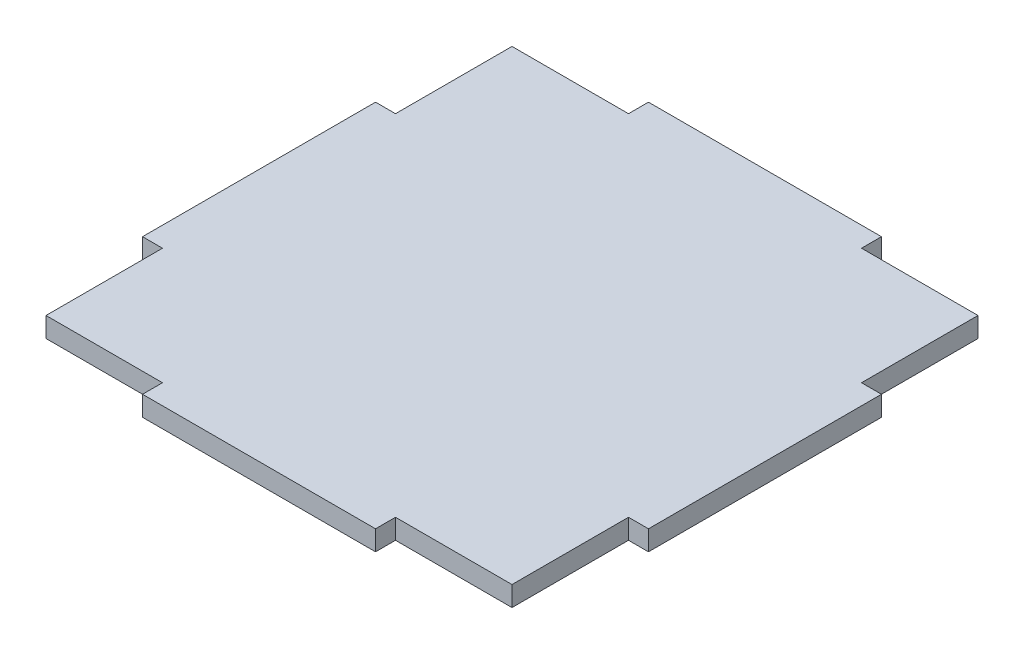
ISO-10303-21;
HEADER;
FILE_DESCRIPTION(('STEP AP214'),'2;1');
FILE_NAME('part.step','',(''),(''),'','','');
FILE_SCHEMA(('AUTOMOTIVE_DESIGN { 1 0 10303 214 1 1 1 1 }'));
ENDSEC;
DATA;
#1=APPLICATION_CONTEXT('core data for automotive mechanical design processes');
#2=APPLICATION_PROTOCOL_DEFINITION('international standard','automotive_design',2000,#1);
#3=PRODUCT_CONTEXT('',#1,'mechanical');
#4=PRODUCT('Part','Part','',(#3));
#5=PRODUCT_RELATED_PRODUCT_CATEGORY('part','',(#4));
#6=PRODUCT_DEFINITION_FORMATION('','',#4);
#7=PRODUCT_DEFINITION_CONTEXT('part definition',#1,'design');
#8=PRODUCT_DEFINITION('design','',#6,#7);
#9=PRODUCT_DEFINITION_SHAPE('','',#8);
#10=(LENGTH_UNIT() NAMED_UNIT(*) SI_UNIT(.MILLI.,.METRE.));
#11=(NAMED_UNIT(*) PLANE_ANGLE_UNIT() SI_UNIT($,.RADIAN.));
#12=(NAMED_UNIT(*) SI_UNIT($,.STERADIAN.) SOLID_ANGLE_UNIT());
#13=UNCERTAINTY_MEASURE_WITH_UNIT(LENGTH_MEASURE(1.E-05),#10,'distance_accuracy_value','');
#14=(GEOMETRIC_REPRESENTATION_CONTEXT(3) GLOBAL_UNCERTAINTY_ASSIGNED_CONTEXT((#13)) GLOBAL_UNIT_ASSIGNED_CONTEXT((#10,
#11,#12)) REPRESENTATION_CONTEXT('',''));
#15=CARTESIAN_POINT('',(0.,0.,0.));
#16=DIRECTION('',(0.,0.,1.));
#17=DIRECTION('',(1.,0.,0.));
#18=AXIS2_PLACEMENT_3D('',#15,#16,#17);
#19=CARTESIAN_POINT('',(35.,3.,-17.5));
#20=DIRECTION('',(-1.,0.,0.));
#21=DIRECTION('',(0.,0.,1.));
#22=AXIS2_PLACEMENT_3D('',#19,#20,#21);
#23=PLANE('',#22);
#24=DIRECTION('',(0.,0.,-1.));
#25=VECTOR('',#24,1.);
#26=CARTESIAN_POINT('',(35.,0.,-17.5));
#27=LINE('',#26,#25);
#28=CARTESIAN_POINT('',(35.,0.,-17.5));
#29=VERTEX_POINT('',#28);
#30=CARTESIAN_POINT('',(35.,0.,-35.));
#31=VERTEX_POINT('',#30);
#32=EDGE_CURVE('E205',#29,#31,#27,.T.);
#33=ORIENTED_EDGE('',*,*,#32,.T.);
#34=DIRECTION('',(0.,-1.,0.));
#35=VECTOR('',#34,1.);
#36=CARTESIAN_POINT('',(35.,3.,-35.));
#37=LINE('',#36,#35);
#38=CARTESIAN_POINT('',(35.,3.,-35.));
#39=VERTEX_POINT('',#38);
#40=EDGE_CURVE('E11',#39,#31,#37,.T.);
#41=ORIENTED_EDGE('',*,*,#40,.F.);
#42=DIRECTION('',(0.,0.,-1.));
#43=VECTOR('',#42,1.);
#44=CARTESIAN_POINT('',(35.,3.,-17.5));
#45=LINE('',#44,#43);
#46=CARTESIAN_POINT('',(35.,3.,-17.5));
#47=VERTEX_POINT('',#46);
#48=EDGE_CURVE('E243',#47,#39,#45,.T.);
#49=ORIENTED_EDGE('',*,*,#48,.F.);
#50=DIRECTION('',(0.,-1.,0.));
#51=VECTOR('',#50,1.);
#52=CARTESIAN_POINT('',(35.,3.,-17.5));
#53=LINE('',#52,#51);
#54=EDGE_CURVE('E201',#47,#29,#53,.T.);
#55=ORIENTED_EDGE('',*,*,#54,.T.);
#56=EDGE_LOOP('',(#33,#41,#49,#55));
#57=FACE_BOUND('',#56,.T.);
#58=ADVANCED_FACE('F37',(#57),#23,.F.);
#59=CARTESIAN_POINT('',(17.5,3.,-35.));
#60=DIRECTION('',(0.,0.,1.));
#61=DIRECTION('',(1.,0.,0.));
#62=AXIS2_PLACEMENT_3D('',#59,#60,#61);
#63=PLANE('',#62);
#64=DIRECTION('',(-1.,0.,0.));
#65=VECTOR('',#64,1.);
#66=CARTESIAN_POINT('',(17.5,0.,-35.));
#67=LINE('',#66,#65);
#68=CARTESIAN_POINT('',(17.5,0.,-35.));
#69=VERTEX_POINT('',#68);
#70=EDGE_CURVE('E208',#31,#69,#67,.T.);
#71=ORIENTED_EDGE('',*,*,#70,.T.);
#72=DIRECTION('',(0.,-1.,0.));
#73=VECTOR('',#72,1.);
#74=CARTESIAN_POINT('',(17.5,3.,-35.));
#75=LINE('',#74,#73);
#76=CARTESIAN_POINT('',(17.5,3.,-35.));
#77=VERTEX_POINT('',#76);
#78=EDGE_CURVE('E45',#77,#69,#75,.T.);
#79=ORIENTED_EDGE('',*,*,#78,.F.);
#80=DIRECTION('',(-1.,0.,0.));
#81=VECTOR('',#80,1.);
#82=CARTESIAN_POINT('',(17.5,3.,-35.));
#83=LINE('',#82,#81);
#84=EDGE_CURVE('E132',#39,#77,#83,.T.);
#85=ORIENTED_EDGE('',*,*,#84,.F.);
#86=ORIENTED_EDGE('',*,*,#40,.T.);
#87=EDGE_LOOP('',(#71,#79,#85,#86));
#88=FACE_BOUND('',#87,.T.);
#89=ADVANCED_FACE('F361',(#88),#63,.F.);
#90=CARTESIAN_POINT('',(17.5,3.,-38.));
#91=DIRECTION('',(-1.,0.,0.));
#92=DIRECTION('',(0.,0.,1.));
#93=AXIS2_PLACEMENT_3D('',#90,#91,#92);
#94=PLANE('',#93);
#95=DIRECTION('',(0.,0.,-1.));
#96=VECTOR('',#95,1.);
#97=CARTESIAN_POINT('',(17.5,0.,-38.));
#98=LINE('',#97,#96);
#99=CARTESIAN_POINT('',(17.5,0.,-38.));
#100=VERTEX_POINT('',#99);
#101=EDGE_CURVE('E210',#69,#100,#98,.T.);
#102=ORIENTED_EDGE('',*,*,#101,.T.);
#103=DIRECTION('',(0.,-1.,0.));
#104=VECTOR('',#103,1.);
#105=CARTESIAN_POINT('',(17.5,3.,-38.));
#106=LINE('',#105,#104);
#107=CARTESIAN_POINT('',(17.5,3.,-38.));
#108=VERTEX_POINT('',#107);
#109=EDGE_CURVE('E286',#108,#100,#106,.T.);
#110=ORIENTED_EDGE('',*,*,#109,.F.);
#111=DIRECTION('',(0.,0.,-1.));
#112=VECTOR('',#111,1.);
#113=CARTESIAN_POINT('',(17.5,3.,-38.));
#114=LINE('',#113,#112);
#115=EDGE_CURVE('E294',#77,#108,#114,.T.);
#116=ORIENTED_EDGE('',*,*,#115,.F.);
#117=ORIENTED_EDGE('',*,*,#78,.T.);
#118=EDGE_LOOP('',(#102,#110,#116,#117));
#119=FACE_BOUND('',#118,.T.);
#120=ADVANCED_FACE('F292',(#119),#94,.F.);
#121=CARTESIAN_POINT('',(-17.5,3.,-38.));
#122=DIRECTION('',(0.,0.,1.));
#123=DIRECTION('',(1.,0.,0.));
#124=AXIS2_PLACEMENT_3D('',#121,#122,#123);
#125=PLANE('',#124);
#126=DIRECTION('',(-1.,0.,0.));
#127=VECTOR('',#126,1.);
#128=CARTESIAN_POINT('',(-17.5,0.,-38.));
#129=LINE('',#128,#127);
#130=CARTESIAN_POINT('',(-17.5,0.,-38.));
#131=VERTEX_POINT('',#130);
#132=EDGE_CURVE('E212',#100,#131,#129,.T.);
#133=ORIENTED_EDGE('',*,*,#132,.T.);
#134=DIRECTION('',(0.,-1.,0.));
#135=VECTOR('',#134,1.);
#136=CARTESIAN_POINT('',(-17.5,3.,-38.));
#137=LINE('',#136,#135);
#138=CARTESIAN_POINT('',(-17.5,3.,-38.));
#139=VERTEX_POINT('',#138);
#140=EDGE_CURVE('E283',#139,#131,#137,.T.);
#141=ORIENTED_EDGE('',*,*,#140,.F.);
#142=DIRECTION('',(-1.,0.,0.));
#143=VECTOR('',#142,1.);
#144=CARTESIAN_POINT('',(-17.5,3.,-38.));
#145=LINE('',#144,#143);
#146=EDGE_CURVE('E312',#108,#139,#145,.T.);
#147=ORIENTED_EDGE('',*,*,#146,.F.);
#148=ORIENTED_EDGE('',*,*,#109,.T.);
#149=EDGE_LOOP('',(#133,#141,#147,#148));
#150=FACE_BOUND('',#149,.T.);
#151=ADVANCED_FACE('F303',(#150),#125,.F.);
#152=CARTESIAN_POINT('',(-17.5,3.,-38.));
#153=DIRECTION('',(1.,0.,0.));
#154=DIRECTION('',(0.,0.,-1.));
#155=AXIS2_PLACEMENT_3D('',#152,#153,#154);
#156=PLANE('',#155);
#157=DIRECTION('',(0.,0.,1.));
#158=VECTOR('',#157,1.);
#159=CARTESIAN_POINT('',(-17.5,0.,-38.));
#160=LINE('',#159,#158);
#161=CARTESIAN_POINT('',(-17.5,0.,-35.));
#162=VERTEX_POINT('',#161);
#163=EDGE_CURVE('E214',#131,#162,#160,.T.);
#164=ORIENTED_EDGE('',*,*,#163,.T.);
#165=DIRECTION('',(0.,-1.,0.));
#166=VECTOR('',#165,1.);
#167=CARTESIAN_POINT('',(-17.5,3.,-35.));
#168=LINE('',#167,#166);
#169=CARTESIAN_POINT('',(-17.5,3.,-35.));
#170=VERTEX_POINT('',#169);
#171=EDGE_CURVE('E280',#170,#162,#168,.T.);
#172=ORIENTED_EDGE('',*,*,#171,.F.);
#173=DIRECTION('',(0.,0.,1.));
#174=VECTOR('',#173,1.);
#175=CARTESIAN_POINT('',(-17.5,3.,-38.));
#176=LINE('',#175,#174);
#177=EDGE_CURVE('E309',#139,#170,#176,.T.);
#178=ORIENTED_EDGE('',*,*,#177,.F.);
#179=ORIENTED_EDGE('',*,*,#140,.T.);
#180=EDGE_LOOP('',(#164,#172,#178,#179));
#181=FACE_BOUND('',#180,.T.);
#182=ADVANCED_FACE('F307',(#181),#156,.F.);
#183=CARTESIAN_POINT('',(-35.,3.,-35.));
#184=DIRECTION('',(0.,0.,1.));
#185=DIRECTION('',(1.,0.,0.));
#186=AXIS2_PLACEMENT_3D('',#183,#184,#185);
#187=PLANE('',#186);
#188=DIRECTION('',(-1.,0.,0.));
#189=VECTOR('',#188,1.);
#190=CARTESIAN_POINT('',(-35.,0.,-35.));
#191=LINE('',#190,#189);
#192=CARTESIAN_POINT('',(-35.,0.,-35.));
#193=VERTEX_POINT('',#192);
#194=EDGE_CURVE('E216',#162,#193,#191,.T.);
#195=ORIENTED_EDGE('',*,*,#194,.T.);
#196=DIRECTION('',(0.,-1.,0.));
#197=VECTOR('',#196,1.);
#198=CARTESIAN_POINT('',(-35.,3.,-35.));
#199=LINE('',#198,#197);
#200=CARTESIAN_POINT('',(-35.,3.,-35.));
#201=VERTEX_POINT('',#200);
#202=EDGE_CURVE('E277',#201,#193,#199,.T.);
#203=ORIENTED_EDGE('',*,*,#202,.F.);
#204=DIRECTION('',(-1.,0.,0.));
#205=VECTOR('',#204,1.);
#206=CARTESIAN_POINT('',(-35.,3.,-35.));
#207=LINE('',#206,#205);
#208=EDGE_CURVE('E311',#170,#201,#207,.T.);
#209=ORIENTED_EDGE('',*,*,#208,.F.);
#210=ORIENTED_EDGE('',*,*,#171,.T.);
#211=EDGE_LOOP('',(#195,#203,#209,#210));
#212=FACE_BOUND('',#211,.T.);
#213=ADVANCED_FACE('F374',(#212),#187,.F.);
#214=CARTESIAN_POINT('',(-35.,3.,-17.5));
#215=DIRECTION('',(1.,0.,0.));
#216=DIRECTION('',(0.,0.,-1.));
#217=AXIS2_PLACEMENT_3D('',#214,#215,#216);
#218=PLANE('',#217);
#219=DIRECTION('',(0.,0.,1.));
#220=VECTOR('',#219,1.);
#221=CARTESIAN_POINT('',(-35.,0.,-17.5));
#222=LINE('',#221,#220);
#223=CARTESIAN_POINT('',(-35.,0.,-17.5));
#224=VERTEX_POINT('',#223);
#225=EDGE_CURVE('E218',#193,#224,#222,.T.);
#226=ORIENTED_EDGE('',*,*,#225,.T.);
#227=DIRECTION('',(0.,-1.,0.));
#228=VECTOR('',#227,1.);
#229=CARTESIAN_POINT('',(-35.,3.,-17.5));
#230=LINE('',#229,#228);
#231=CARTESIAN_POINT('',(-35.,3.,-17.5));
#232=VERTEX_POINT('',#231);
#233=EDGE_CURVE('E274',#232,#224,#230,.T.);
#234=ORIENTED_EDGE('',*,*,#233,.F.);
#235=DIRECTION('',(0.,0.,1.));
#236=VECTOR('',#235,1.);
#237=CARTESIAN_POINT('',(-35.,3.,-17.5));
#238=LINE('',#237,#236);
#239=EDGE_CURVE('E314',#201,#232,#238,.T.);
#240=ORIENTED_EDGE('',*,*,#239,.F.);
#241=ORIENTED_EDGE('',*,*,#202,.T.);
#242=EDGE_LOOP('',(#226,#234,#240,#241));
#243=FACE_BOUND('',#242,.T.);
#244=ADVANCED_FACE('F377',(#243),#218,.F.);
#245=CARTESIAN_POINT('',(-38.,3.,-17.5));
#246=DIRECTION('',(0.,0.,1.));
#247=DIRECTION('',(1.,0.,0.));
#248=AXIS2_PLACEMENT_3D('',#245,#246,#247);
#249=PLANE('',#248);
#250=DIRECTION('',(-1.,0.,0.));
#251=VECTOR('',#250,1.);
#252=CARTESIAN_POINT('',(-38.,0.,-17.5));
#253=LINE('',#252,#251);
#254=CARTESIAN_POINT('',(-38.,0.,-17.5));
#255=VERTEX_POINT('',#254);
#256=EDGE_CURVE('E220',#224,#255,#253,.T.);
#257=ORIENTED_EDGE('',*,*,#256,.T.);
#258=DIRECTION('',(0.,-1.,0.));
#259=VECTOR('',#258,1.);
#260=CARTESIAN_POINT('',(-38.,3.,-17.5));
#261=LINE('',#260,#259);
#262=CARTESIAN_POINT('',(-38.,3.,-17.5));
#263=VERTEX_POINT('',#262);
#264=EDGE_CURVE('E271',#263,#255,#261,.T.);
#265=ORIENTED_EDGE('',*,*,#264,.F.);
#266=DIRECTION('',(-1.,0.,0.));
#267=VECTOR('',#266,1.);
#268=CARTESIAN_POINT('',(-38.,3.,-17.5));
#269=LINE('',#268,#267);
#270=EDGE_CURVE('E320',#232,#263,#269,.T.);
#271=ORIENTED_EDGE('',*,*,#270,.F.);
#272=ORIENTED_EDGE('',*,*,#233,.T.);
#273=EDGE_LOOP('',(#257,#265,#271,#272));
#274=FACE_BOUND('',#273,.T.);
#275=ADVANCED_FACE('F381',(#274),#249,.F.);
#276=CARTESIAN_POINT('',(-38.,3.,17.5));
#277=DIRECTION('',(1.,0.,0.));
#278=DIRECTION('',(0.,0.,-1.));
#279=AXIS2_PLACEMENT_3D('',#276,#277,#278);
#280=PLANE('',#279);
#281=DIRECTION('',(0.,0.,1.));
#282=VECTOR('',#281,1.);
#283=CARTESIAN_POINT('',(-38.,0.,17.5));
#284=LINE('',#283,#282);
#285=CARTESIAN_POINT('',(-38.,0.,17.5));
#286=VERTEX_POINT('',#285);
#287=EDGE_CURVE('E222',#255,#286,#284,.T.);
#288=ORIENTED_EDGE('',*,*,#287,.T.);
#289=DIRECTION('',(0.,-1.,0.));
#290=VECTOR('',#289,1.);
#291=CARTESIAN_POINT('',(-38.,3.,17.5));
#292=LINE('',#291,#290);
#293=CARTESIAN_POINT('',(-38.,3.,17.5));
#294=VERTEX_POINT('',#293);
#295=EDGE_CURVE('E268',#294,#286,#292,.T.);
#296=ORIENTED_EDGE('',*,*,#295,.F.);
#297=DIRECTION('',(0.,0.,1.));
#298=VECTOR('',#297,1.);
#299=CARTESIAN_POINT('',(-38.,3.,17.5));
#300=LINE('',#299,#298);
#301=EDGE_CURVE('E322',#263,#294,#300,.T.);
#302=ORIENTED_EDGE('',*,*,#301,.F.);
#303=ORIENTED_EDGE('',*,*,#264,.T.);
#304=EDGE_LOOP('',(#288,#296,#302,#303));
#305=FACE_BOUND('',#304,.T.);
#306=ADVANCED_FACE('F385',(#305),#280,.F.);
#307=CARTESIAN_POINT('',(-38.,3.,17.5));
#308=DIRECTION('',(0.,0.,-1.));
#309=DIRECTION('',(-1.,0.,0.));
#310=AXIS2_PLACEMENT_3D('',#307,#308,#309);
#311=PLANE('',#310);
#312=DIRECTION('',(1.,0.,0.));
#313=VECTOR('',#312,1.);
#314=CARTESIAN_POINT('',(-38.,0.,17.5));
#315=LINE('',#314,#313);
#316=CARTESIAN_POINT('',(-35.,0.,17.5));
#317=VERTEX_POINT('',#316);
#318=EDGE_CURVE('E224',#286,#317,#315,.T.);
#319=ORIENTED_EDGE('',*,*,#318,.T.);
#320=DIRECTION('',(0.,-1.,0.));
#321=VECTOR('',#320,1.);
#322=CARTESIAN_POINT('',(-35.,3.,17.5));
#323=LINE('',#322,#321);
#324=CARTESIAN_POINT('',(-35.,3.,17.5));
#325=VERTEX_POINT('',#324);
#326=EDGE_CURVE('E265',#325,#317,#323,.T.);
#327=ORIENTED_EDGE('',*,*,#326,.F.);
#328=DIRECTION('',(1.,0.,0.));
#329=VECTOR('',#328,1.);
#330=CARTESIAN_POINT('',(-38.,3.,17.5));
#331=LINE('',#330,#329);
#332=EDGE_CURVE('E324',#294,#325,#331,.T.);
#333=ORIENTED_EDGE('',*,*,#332,.F.);
#334=ORIENTED_EDGE('',*,*,#295,.T.);
#335=EDGE_LOOP('',(#319,#327,#333,#334));
#336=FACE_BOUND('',#335,.T.);
#337=ADVANCED_FACE('F389',(#336),#311,.F.);
#338=CARTESIAN_POINT('',(-35.,3.,35.));
#339=DIRECTION('',(1.,0.,0.));
#340=DIRECTION('',(0.,0.,-1.));
#341=AXIS2_PLACEMENT_3D('',#338,#339,#340);
#342=PLANE('',#341);
#343=DIRECTION('',(0.,0.,1.));
#344=VECTOR('',#343,1.);
#345=CARTESIAN_POINT('',(-35.,0.,35.));
#346=LINE('',#345,#344);
#347=CARTESIAN_POINT('',(-35.,0.,35.));
#348=VERTEX_POINT('',#347);
#349=EDGE_CURVE('E226',#317,#348,#346,.T.);
#350=ORIENTED_EDGE('',*,*,#349,.T.);
#351=DIRECTION('',(0.,-1.,0.));
#352=VECTOR('',#351,1.);
#353=CARTESIAN_POINT('',(-35.,3.,35.));
#354=LINE('',#353,#352);
#355=CARTESIAN_POINT('',(-35.,3.,35.));
#356=VERTEX_POINT('',#355);
#357=EDGE_CURVE('E262',#356,#348,#354,.T.);
#358=ORIENTED_EDGE('',*,*,#357,.F.);
#359=DIRECTION('',(0.,0.,1.));
#360=VECTOR('',#359,1.);
#361=CARTESIAN_POINT('',(-35.,3.,35.));
#362=LINE('',#361,#360);
#363=EDGE_CURVE('E326',#325,#356,#362,.T.);
#364=ORIENTED_EDGE('',*,*,#363,.F.);
#365=ORIENTED_EDGE('',*,*,#326,.T.);
#366=EDGE_LOOP('',(#350,#358,#364,#365));
#367=FACE_BOUND('',#366,.T.);
#368=ADVANCED_FACE('F393',(#367),#342,.F.);
#369=CARTESIAN_POINT('',(-35.,3.,35.));
#370=DIRECTION('',(0.,0.,-1.));
#371=DIRECTION('',(-1.,0.,0.));
#372=AXIS2_PLACEMENT_3D('',#369,#370,#371);
#373=PLANE('',#372);
#374=DIRECTION('',(1.,0.,0.));
#375=VECTOR('',#374,1.);
#376=CARTESIAN_POINT('',(-35.,0.,35.));
#377=LINE('',#376,#375);
#378=CARTESIAN_POINT('',(-17.5,0.,35.));
#379=VERTEX_POINT('',#378);
#380=EDGE_CURVE('E228',#348,#379,#377,.T.);
#381=ORIENTED_EDGE('',*,*,#380,.T.);
#382=DIRECTION('',(0.,-1.,0.));
#383=VECTOR('',#382,1.);
#384=CARTESIAN_POINT('',(-17.5,3.,35.));
#385=LINE('',#384,#383);
#386=CARTESIAN_POINT('',(-17.5,3.,35.));
#387=VERTEX_POINT('',#386);
#388=EDGE_CURVE('E259',#387,#379,#385,.T.);
#389=ORIENTED_EDGE('',*,*,#388,.F.);
#390=DIRECTION('',(1.,0.,0.));
#391=VECTOR('',#390,1.);
#392=CARTESIAN_POINT('',(-35.,3.,35.));
#393=LINE('',#392,#391);
#394=EDGE_CURVE('E328',#356,#387,#393,.T.);
#395=ORIENTED_EDGE('',*,*,#394,.F.);
#396=ORIENTED_EDGE('',*,*,#357,.T.);
#397=EDGE_LOOP('',(#381,#389,#395,#396));
#398=FACE_BOUND('',#397,.T.);
#399=ADVANCED_FACE('F397',(#398),#373,.F.);
#400=CARTESIAN_POINT('',(-17.5,3.,38.));
#401=DIRECTION('',(1.,0.,0.));
#402=DIRECTION('',(0.,0.,-1.));
#403=AXIS2_PLACEMENT_3D('',#400,#401,#402);
#404=PLANE('',#403);
#405=DIRECTION('',(0.,0.,1.));
#406=VECTOR('',#405,1.);
#407=CARTESIAN_POINT('',(-17.5,0.,38.));
#408=LINE('',#407,#406);
#409=CARTESIAN_POINT('',(-17.5,0.,38.));
#410=VERTEX_POINT('',#409);
#411=EDGE_CURVE('E230',#379,#410,#408,.T.);
#412=ORIENTED_EDGE('',*,*,#411,.T.);
#413=DIRECTION('',(0.,-1.,0.));
#414=VECTOR('',#413,1.);
#415=CARTESIAN_POINT('',(-17.5,3.,38.));
#416=LINE('',#415,#414);
#417=CARTESIAN_POINT('',(-17.5,3.,38.));
#418=VERTEX_POINT('',#417);
#419=EDGE_CURVE('E256',#418,#410,#416,.T.);
#420=ORIENTED_EDGE('',*,*,#419,.F.);
#421=DIRECTION('',(0.,0.,1.));
#422=VECTOR('',#421,1.);
#423=CARTESIAN_POINT('',(-17.5,3.,38.));
#424=LINE('',#423,#422);
#425=EDGE_CURVE('E330',#387,#418,#424,.T.);
#426=ORIENTED_EDGE('',*,*,#425,.F.);
#427=ORIENTED_EDGE('',*,*,#388,.T.);
#428=EDGE_LOOP('',(#412,#420,#426,#427));
#429=FACE_BOUND('',#428,.T.);
#430=ADVANCED_FACE('F401',(#429),#404,.F.);
#431=CARTESIAN_POINT('',(-17.5,3.,38.));
#432=DIRECTION('',(0.,0.,-1.));
#433=DIRECTION('',(-1.,0.,0.));
#434=AXIS2_PLACEMENT_3D('',#431,#432,#433);
#435=PLANE('',#434);
#436=DIRECTION('',(1.,0.,0.));
#437=VECTOR('',#436,1.);
#438=CARTESIAN_POINT('',(-17.5,0.,38.));
#439=LINE('',#438,#437);
#440=CARTESIAN_POINT('',(17.5,0.,38.));
#441=VERTEX_POINT('',#440);
#442=EDGE_CURVE('E232',#410,#441,#439,.T.);
#443=ORIENTED_EDGE('',*,*,#442,.T.);
#444=DIRECTION('',(0.,-1.,0.));
#445=VECTOR('',#444,1.);
#446=CARTESIAN_POINT('',(17.5,3.,38.));
#447=LINE('',#446,#445);
#448=CARTESIAN_POINT('',(17.5,3.,38.));
#449=VERTEX_POINT('',#448);
#450=EDGE_CURVE('E253',#449,#441,#447,.T.);
#451=ORIENTED_EDGE('',*,*,#450,.F.);
#452=DIRECTION('',(1.,0.,0.));
#453=VECTOR('',#452,1.);
#454=CARTESIAN_POINT('',(-17.5,3.,38.));
#455=LINE('',#454,#453);
#456=EDGE_CURVE('E332',#418,#449,#455,.T.);
#457=ORIENTED_EDGE('',*,*,#456,.F.);
#458=ORIENTED_EDGE('',*,*,#419,.T.);
#459=EDGE_LOOP('',(#443,#451,#457,#458));
#460=FACE_BOUND('',#459,.T.);
#461=ADVANCED_FACE('F405',(#460),#435,.F.);
#462=CARTESIAN_POINT('',(17.5,3.,38.));
#463=DIRECTION('',(-1.,0.,0.));
#464=DIRECTION('',(0.,0.,1.));
#465=AXIS2_PLACEMENT_3D('',#462,#463,#464);
#466=PLANE('',#465);
#467=DIRECTION('',(0.,0.,-1.));
#468=VECTOR('',#467,1.);
#469=CARTESIAN_POINT('',(17.5,0.,38.));
#470=LINE('',#469,#468);
#471=CARTESIAN_POINT('',(17.5,0.,35.));
#472=VERTEX_POINT('',#471);
#473=EDGE_CURVE('E234',#441,#472,#470,.T.);
#474=ORIENTED_EDGE('',*,*,#473,.T.);
#475=DIRECTION('',(0.,-1.,0.));
#476=VECTOR('',#475,1.);
#477=CARTESIAN_POINT('',(17.5,3.,35.));
#478=LINE('',#477,#476);
#479=CARTESIAN_POINT('',(17.5,3.,35.));
#480=VERTEX_POINT('',#479);
#481=EDGE_CURVE('E250',#480,#472,#478,.T.);
#482=ORIENTED_EDGE('',*,*,#481,.F.);
#483=DIRECTION('',(0.,0.,-1.));
#484=VECTOR('',#483,1.);
#485=CARTESIAN_POINT('',(17.5,3.,38.));
#486=LINE('',#485,#484);
#487=EDGE_CURVE('E334',#449,#480,#486,.T.);
#488=ORIENTED_EDGE('',*,*,#487,.F.);
#489=ORIENTED_EDGE('',*,*,#450,.T.);
#490=EDGE_LOOP('',(#474,#482,#488,#489));
#491=FACE_BOUND('',#490,.T.);
#492=ADVANCED_FACE('F409',(#491),#466,.F.);
#493=CARTESIAN_POINT('',(17.5,3.,35.));
#494=DIRECTION('',(0.,0.,-1.));
#495=DIRECTION('',(-1.,0.,0.));
#496=AXIS2_PLACEMENT_3D('',#493,#494,#495);
#497=PLANE('',#496);
#498=DIRECTION('',(1.,0.,0.));
#499=VECTOR('',#498,1.);
#500=CARTESIAN_POINT('',(17.5,0.,35.));
#501=LINE('',#500,#499);
#502=CARTESIAN_POINT('',(35.,0.,35.));
#503=VERTEX_POINT('',#502);
#504=EDGE_CURVE('E236',#472,#503,#501,.T.);
#505=ORIENTED_EDGE('',*,*,#504,.T.);
#506=DIRECTION('',(0.,-1.,0.));
#507=VECTOR('',#506,1.);
#508=CARTESIAN_POINT('',(35.,3.,35.));
#509=LINE('',#508,#507);
#510=CARTESIAN_POINT('',(35.,3.,35.));
#511=VERTEX_POINT('',#510);
#512=EDGE_CURVE('E247',#511,#503,#509,.T.);
#513=ORIENTED_EDGE('',*,*,#512,.F.);
#514=DIRECTION('',(1.,0.,0.));
#515=VECTOR('',#514,1.);
#516=CARTESIAN_POINT('',(17.5,3.,35.));
#517=LINE('',#516,#515);
#518=EDGE_CURVE('E336',#480,#511,#517,.T.);
#519=ORIENTED_EDGE('',*,*,#518,.F.);
#520=ORIENTED_EDGE('',*,*,#481,.T.);
#521=EDGE_LOOP('',(#505,#513,#519,#520));
#522=FACE_BOUND('',#521,.T.);
#523=ADVANCED_FACE('F342',(#522),#497,.F.);
#524=CARTESIAN_POINT('',(35.,3.,35.));
#525=DIRECTION('',(-1.,0.,0.));
#526=DIRECTION('',(0.,0.,1.));
#527=AXIS2_PLACEMENT_3D('',#524,#525,#526);
#528=PLANE('',#527);
#529=DIRECTION('',(0.,0.,-1.));
#530=VECTOR('',#529,1.);
#531=CARTESIAN_POINT('',(35.,0.,35.));
#532=LINE('',#531,#530);
#533=CARTESIAN_POINT('',(35.,0.,17.5));
#534=VERTEX_POINT('',#533);
#535=EDGE_CURVE('E238',#503,#534,#532,.T.);
#536=ORIENTED_EDGE('',*,*,#535,.T.);
#537=DIRECTION('',(0.,-1.,0.));
#538=VECTOR('',#537,1.);
#539=CARTESIAN_POINT('',(35.,3.,17.5));
#540=LINE('',#539,#538);
#541=CARTESIAN_POINT('',(35.,3.,17.5));
#542=VERTEX_POINT('',#541);
#543=EDGE_CURVE('E196',#542,#534,#540,.T.);
#544=ORIENTED_EDGE('',*,*,#543,.F.);
#545=DIRECTION('',(0.,0.,-1.));
#546=VECTOR('',#545,1.);
#547=CARTESIAN_POINT('',(35.,3.,35.));
#548=LINE('',#547,#546);
#549=EDGE_CURVE('E187',#511,#542,#548,.T.);
#550=ORIENTED_EDGE('',*,*,#549,.F.);
#551=ORIENTED_EDGE('',*,*,#512,.T.);
#552=EDGE_LOOP('',(#536,#544,#550,#551));
#553=FACE_BOUND('',#552,.T.);
#554=ADVANCED_FACE('F346',(#553),#528,.F.);
#555=CARTESIAN_POINT('',(38.,3.,17.5));
#556=DIRECTION('',(0.,0.,-1.));
#557=DIRECTION('',(-1.,0.,0.));
#558=AXIS2_PLACEMENT_3D('',#555,#556,#557);
#559=PLANE('',#558);
#560=DIRECTION('',(1.,0.,0.));
#561=VECTOR('',#560,1.);
#562=CARTESIAN_POINT('',(38.,0.,17.5));
#563=LINE('',#562,#561);
#564=CARTESIAN_POINT('',(38.,0.,17.5));
#565=VERTEX_POINT('',#564);
#566=EDGE_CURVE('E195',#534,#565,#563,.T.);
#567=ORIENTED_EDGE('',*,*,#566,.T.);
#568=DIRECTION('',(0.,-1.,0.));
#569=VECTOR('',#568,1.);
#570=CARTESIAN_POINT('',(38.,3.,17.5));
#571=LINE('',#570,#569);
#572=CARTESIAN_POINT('',(38.,3.,17.5));
#573=VERTEX_POINT('',#572);
#574=EDGE_CURVE('E192',#573,#565,#571,.T.);
#575=ORIENTED_EDGE('',*,*,#574,.F.);
#576=DIRECTION('',(1.,0.,0.));
#577=VECTOR('',#576,1.);
#578=CARTESIAN_POINT('',(38.,3.,17.5));
#579=LINE('',#578,#577);
#580=EDGE_CURVE('E181',#542,#573,#579,.T.);
#581=ORIENTED_EDGE('',*,*,#580,.F.);
#582=ORIENTED_EDGE('',*,*,#543,.T.);
#583=EDGE_LOOP('',(#567,#575,#581,#582));
#584=FACE_BOUND('',#583,.T.);
#585=ADVANCED_FACE('F193',(#584),#559,.F.);
#586=CARTESIAN_POINT('',(38.,3.,-17.5));
#587=DIRECTION('',(-1.,0.,0.));
#588=DIRECTION('',(0.,0.,1.));
#589=AXIS2_PLACEMENT_3D('',#586,#587,#588);
#590=PLANE('',#589);
#591=DIRECTION('',(0.,0.,-1.));
#592=VECTOR('',#591,1.);
#593=CARTESIAN_POINT('',(38.,0.,-17.5));
#594=LINE('',#593,#592);
#595=CARTESIAN_POINT('',(38.,0.,-17.5));
#596=VERTEX_POINT('',#595);
#597=EDGE_CURVE('E118',#565,#596,#594,.T.);
#598=ORIENTED_EDGE('',*,*,#597,.T.);
#599=DIRECTION('',(0.,-1.,0.));
#600=VECTOR('',#599,1.);
#601=CARTESIAN_POINT('',(38.,3.,-17.5));
#602=LINE('',#601,#600);
#603=CARTESIAN_POINT('',(38.,3.,-17.5));
#604=VERTEX_POINT('',#603);
#605=EDGE_CURVE('E197',#604,#596,#602,.T.);
#606=ORIENTED_EDGE('',*,*,#605,.F.);
#607=DIRECTION('',(0.,0.,-1.));
#608=VECTOR('',#607,1.);
#609=CARTESIAN_POINT('',(38.,3.,-17.5));
#610=LINE('',#609,#608);
#611=EDGE_CURVE('E185',#573,#604,#610,.T.);
#612=ORIENTED_EDGE('',*,*,#611,.F.);
#613=ORIENTED_EDGE('',*,*,#574,.T.);
#614=EDGE_LOOP('',(#598,#606,#612,#613));
#615=FACE_BOUND('',#614,.T.);
#616=ADVANCED_FACE('F199',(#615),#590,.F.);
#617=CARTESIAN_POINT('',(38.,3.,-17.5));
#618=DIRECTION('',(0.,0.,1.));
#619=DIRECTION('',(1.,0.,0.));
#620=AXIS2_PLACEMENT_3D('',#617,#618,#619);
#621=PLANE('',#620);
#622=DIRECTION('',(-1.,0.,0.));
#623=VECTOR('',#622,1.);
#624=CARTESIAN_POINT('',(38.,0.,-17.5));
#625=LINE('',#624,#623);
#626=EDGE_CURVE('E124',#596,#29,#625,.T.);
#627=ORIENTED_EDGE('',*,*,#626,.T.);
#628=ORIENTED_EDGE('',*,*,#54,.F.);
#629=DIRECTION('',(-1.,0.,0.));
#630=VECTOR('',#629,1.);
#631=CARTESIAN_POINT('',(38.,3.,-17.5));
#632=LINE('',#631,#630);
#633=EDGE_CURVE('E53',#604,#47,#632,.T.);
#634=ORIENTED_EDGE('',*,*,#633,.F.);
#635=ORIENTED_EDGE('',*,*,#605,.T.);
#636=EDGE_LOOP('',(#627,#628,#634,#635));
#637=FACE_BOUND('',#636,.T.);
#638=ADVANCED_FACE('F350',(#637),#621,.F.);
#639=CARTESIAN_POINT('',(0.,3.,0.));
#640=DIRECTION('',(0.,-1.,0.));
#641=DIRECTION('',(0.,0.,-1.));
#642=AXIS2_PLACEMENT_3D('',#639,#640,#641);
#643=PLANE('',#642);
#644=ORIENTED_EDGE('',*,*,#48,.T.);
#645=ORIENTED_EDGE('',*,*,#84,.T.);
#646=ORIENTED_EDGE('',*,*,#115,.T.);
#647=ORIENTED_EDGE('',*,*,#146,.T.);
#648=ORIENTED_EDGE('',*,*,#177,.T.);
#649=ORIENTED_EDGE('',*,*,#208,.T.);
#650=ORIENTED_EDGE('',*,*,#239,.T.);
#651=ORIENTED_EDGE('',*,*,#270,.T.);
#652=ORIENTED_EDGE('',*,*,#301,.T.);
#653=ORIENTED_EDGE('',*,*,#332,.T.);
#654=ORIENTED_EDGE('',*,*,#363,.T.);
#655=ORIENTED_EDGE('',*,*,#394,.T.);
#656=ORIENTED_EDGE('',*,*,#425,.T.);
#657=ORIENTED_EDGE('',*,*,#456,.T.);
#658=ORIENTED_EDGE('',*,*,#487,.T.);
#659=ORIENTED_EDGE('',*,*,#518,.T.);
#660=ORIENTED_EDGE('',*,*,#549,.T.);
#661=ORIENTED_EDGE('',*,*,#580,.T.);
#662=ORIENTED_EDGE('',*,*,#611,.T.);
#663=ORIENTED_EDGE('',*,*,#633,.T.);
#664=EDGE_LOOP('',(#644,#645,#646,#647,#648,#649,#650,#651,#652,#653,#654,#655,#656,#657,#658,
#659,#660,#661,#662,#663));
#665=FACE_BOUND('',#664,.T.);
#666=ADVANCED_FACE('F183',(#665),#643,.F.);
#667=CARTESIAN_POINT('',(0.,0.,0.));
#668=DIRECTION('',(0.,-1.,0.));
#669=DIRECTION('',(0.,0.,-1.));
#670=AXIS2_PLACEMENT_3D('',#667,#668,#669);
#671=PLANE('',#670);
#672=ORIENTED_EDGE('',*,*,#32,.F.);
#673=ORIENTED_EDGE('',*,*,#626,.F.);
#674=ORIENTED_EDGE('',*,*,#597,.F.);
#675=ORIENTED_EDGE('',*,*,#566,.F.);
#676=ORIENTED_EDGE('',*,*,#535,.F.);
#677=ORIENTED_EDGE('',*,*,#504,.F.);
#678=ORIENTED_EDGE('',*,*,#473,.F.);
#679=ORIENTED_EDGE('',*,*,#442,.F.);
#680=ORIENTED_EDGE('',*,*,#411,.F.);
#681=ORIENTED_EDGE('',*,*,#380,.F.);
#682=ORIENTED_EDGE('',*,*,#349,.F.);
#683=ORIENTED_EDGE('',*,*,#318,.F.);
#684=ORIENTED_EDGE('',*,*,#287,.F.);
#685=ORIENTED_EDGE('',*,*,#256,.F.);
#686=ORIENTED_EDGE('',*,*,#225,.F.);
#687=ORIENTED_EDGE('',*,*,#194,.F.);
#688=ORIENTED_EDGE('',*,*,#163,.F.);
#689=ORIENTED_EDGE('',*,*,#132,.F.);
#690=ORIENTED_EDGE('',*,*,#101,.F.);
#691=ORIENTED_EDGE('',*,*,#70,.F.);
#692=EDGE_LOOP('',(#672,#673,#674,#675,#676,#677,#678,#679,#680,#681,#682,#683,#684,#685,#686,
#687,#688,#689,#690,#691));
#693=FACE_BOUND('',#692,.T.);
#694=ADVANCED_FACE('F298',(#693),#671,.T.);
#695=CLOSED_SHELL('',(#58,#89,#120,#151,#182,#213,#244,#275,#306,#337,#368,#399,#430,#461,#492,
#523,#554,#585,#616,#638,#666,#694));
#696=MANIFOLD_SOLID_BREP('B2',#695);
#697=ADVANCED_BREP_SHAPE_REPRESENTATION('',(#18,#696),#14);
#698=SHAPE_DEFINITION_REPRESENTATION(#9,#697);
ENDSEC;
END-ISO-10303-21;
